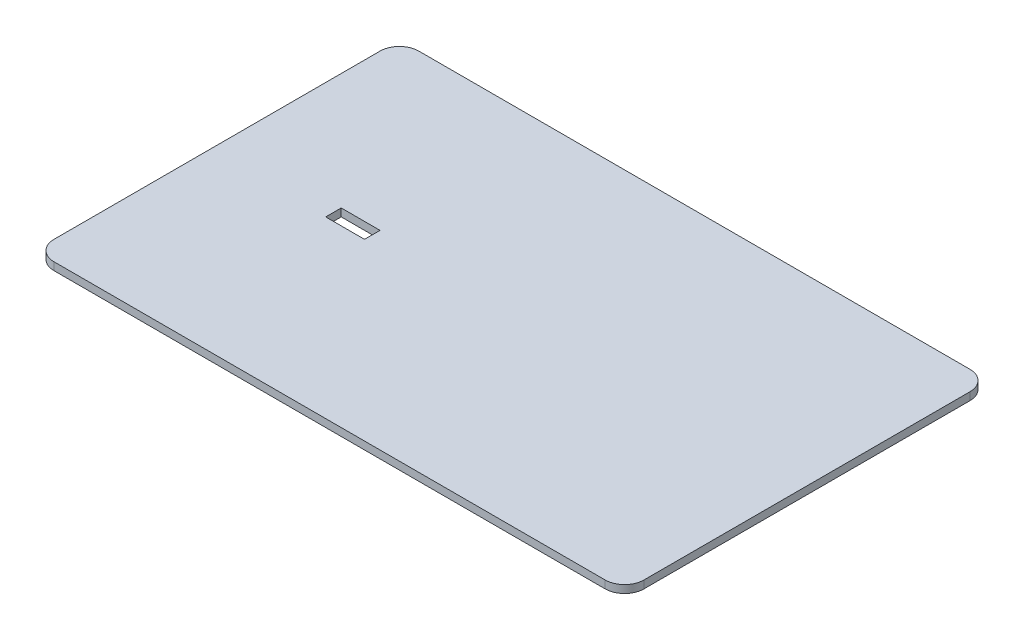
ISO-10303-21;
HEADER;
FILE_DESCRIPTION(('STEP AP214'),'2;1');
FILE_NAME('part.step','',(''),(''),'','','');
FILE_SCHEMA(('AUTOMOTIVE_DESIGN { 1 0 10303 214 1 1 1 1 }'));
ENDSEC;
DATA;
#1=APPLICATION_CONTEXT('core data for automotive mechanical design processes');
#2=APPLICATION_PROTOCOL_DEFINITION('international standard','automotive_design',2000,#1);
#3=PRODUCT_CONTEXT('',#1,'mechanical');
#4=PRODUCT('Part','Part','',(#3));
#5=PRODUCT_RELATED_PRODUCT_CATEGORY('part','',(#4));
#6=PRODUCT_DEFINITION_FORMATION('','',#4);
#7=PRODUCT_DEFINITION_CONTEXT('part definition',#1,'design');
#8=PRODUCT_DEFINITION('design','',#6,#7);
#9=PRODUCT_DEFINITION_SHAPE('','',#8);
#10=(LENGTH_UNIT() NAMED_UNIT(*) SI_UNIT(.MILLI.,.METRE.));
#11=(NAMED_UNIT(*) PLANE_ANGLE_UNIT() SI_UNIT($,.RADIAN.));
#12=(NAMED_UNIT(*) SI_UNIT($,.STERADIAN.) SOLID_ANGLE_UNIT());
#13=UNCERTAINTY_MEASURE_WITH_UNIT(LENGTH_MEASURE(1.E-05),#10,'distance_accuracy_value','');
#14=(GEOMETRIC_REPRESENTATION_CONTEXT(3) GLOBAL_UNCERTAINTY_ASSIGNED_CONTEXT((#13)) GLOBAL_UNIT_ASSIGNED_CONTEXT((#10,
#11,#12)) REPRESENTATION_CONTEXT('',''));
#15=CARTESIAN_POINT('',(0.,0.,0.));
#16=DIRECTION('',(0.,0.,1.));
#17=DIRECTION('',(1.,0.,0.));
#18=AXIS2_PLACEMENT_3D('',#15,#16,#17);
#19=CARTESIAN_POINT('',(0.,-1.,0.));
#20=DIRECTION('',(0.,1.,0.));
#21=DIRECTION('',(0.,0.,1.));
#22=AXIS2_PLACEMENT_3D('',#19,#20,#21);
#23=PLANE('',#22);
#24=DIRECTION('',(-1.,0.,0.));
#25=VECTOR('',#24,1.);
#26=CARTESIAN_POINT('',(-38.,-1.,-23.5));
#27=LINE('',#26,#25);
#28=CARTESIAN_POINT('',(35.5,-1.,-23.5));
#29=VERTEX_POINT('',#28);
#30=CARTESIAN_POINT('',(-35.5,-1.,-23.5));
#31=VERTEX_POINT('',#30);
#32=EDGE_CURVE('E314',#29,#31,#27,.T.);
#33=ORIENTED_EDGE('',*,*,#32,.F.);
#34=CARTESIAN_POINT('',(35.5,-1.,-21.));
#35=DIRECTION('',(0.,1.,0.));
#36=DIRECTION('',(0.,0.,1.));
#37=AXIS2_PLACEMENT_3D('',#34,#35,#36);
#38=CIRCLE('',#37,2.5);
#39=CARTESIAN_POINT('',(38.,-1.,-21.));
#40=VERTEX_POINT('',#39);
#41=EDGE_CURVE('E376',#29,#40,#38,.F.);
#42=ORIENTED_EDGE('',*,*,#41,.T.);
#43=DIRECTION('',(0.,0.,-1.));
#44=VECTOR('',#43,1.);
#45=CARTESIAN_POINT('',(38.,-1.,-23.5));
#46=LINE('',#45,#44);
#47=CARTESIAN_POINT('',(38.,-1.,21.));
#48=VERTEX_POINT('',#47);
#49=EDGE_CURVE('E310',#48,#40,#46,.T.);
#50=ORIENTED_EDGE('',*,*,#49,.F.);
#51=CARTESIAN_POINT('',(35.5,-1.,21.));
#52=DIRECTION('',(0.,1.,0.));
#53=DIRECTION('',(0.,0.,1.));
#54=AXIS2_PLACEMENT_3D('',#51,#52,#53);
#55=CIRCLE('',#54,2.5);
#56=CARTESIAN_POINT('',(35.5,-1.,23.5));
#57=VERTEX_POINT('',#56);
#58=EDGE_CURVE('E370',#48,#57,#55,.F.);
#59=ORIENTED_EDGE('',*,*,#58,.T.);
#60=DIRECTION('',(1.,0.,0.));
#61=VECTOR('',#60,1.);
#62=CARTESIAN_POINT('',(-38.,-1.,23.5));
#63=LINE('',#62,#61);
#64=CARTESIAN_POINT('',(-35.5,-1.,23.5));
#65=VERTEX_POINT('',#64);
#66=EDGE_CURVE('E323',#65,#57,#63,.T.);
#67=ORIENTED_EDGE('',*,*,#66,.F.);
#68=CARTESIAN_POINT('',(-35.5,-1.,21.));
#69=DIRECTION('',(0.,1.,0.));
#70=DIRECTION('',(0.,0.,1.));
#71=AXIS2_PLACEMENT_3D('',#68,#69,#70);
#72=CIRCLE('',#71,2.5);
#73=CARTESIAN_POINT('',(-38.,-1.,21.));
#74=VERTEX_POINT('',#73);
#75=EDGE_CURVE('E367',#65,#74,#72,.F.);
#76=ORIENTED_EDGE('',*,*,#75,.T.);
#77=DIRECTION('',(0.,0.,1.));
#78=VECTOR('',#77,1.);
#79=CARTESIAN_POINT('',(-38.,-1.,-23.5));
#80=LINE('',#79,#78);
#81=CARTESIAN_POINT('',(-38.,-1.,-21.));
#82=VERTEX_POINT('',#81);
#83=EDGE_CURVE('E319',#82,#74,#80,.T.);
#84=ORIENTED_EDGE('',*,*,#83,.F.);
#85=CARTESIAN_POINT('',(-35.5,-1.,-21.));
#86=DIRECTION('',(0.,1.,0.));
#87=DIRECTION('',(0.,0.,1.));
#88=AXIS2_PLACEMENT_3D('',#85,#86,#87);
#89=CIRCLE('',#88,2.5);
#90=EDGE_CURVE('E373',#82,#31,#89,.F.);
#91=ORIENTED_EDGE('',*,*,#90,.T.);
#92=EDGE_LOOP('',(#33,#42,#50,#59,#67,#76,#84,#91));
#93=FACE_BOUND('',#92,.T.);
#94=DIRECTION('',(0.,0.,1.));
#95=VECTOR('',#94,1.);
#96=CARTESIAN_POINT('',(33.,-1.,20.5));
#97=LINE('',#96,#95);
#98=CARTESIAN_POINT('',(33.,-1.,-20.5));
#99=VERTEX_POINT('',#98);
#100=CARTESIAN_POINT('',(33.,-1.,20.5));
#101=VERTEX_POINT('',#100);
#102=EDGE_CURVE('E264',#99,#101,#97,.T.);
#103=ORIENTED_EDGE('',*,*,#102,.F.);
#104=DIRECTION('',(1.,0.,0.));
#105=VECTOR('',#104,1.);
#106=CARTESIAN_POINT('',(-33.,-1.,-20.5));
#107=LINE('',#106,#105);
#108=CARTESIAN_POINT('',(-33.,-1.,-20.5));
#109=VERTEX_POINT('',#108);
#110=EDGE_CURVE('E270',#109,#99,#107,.T.);
#111=ORIENTED_EDGE('',*,*,#110,.F.);
#112=DIRECTION('',(0.,0.,-1.));
#113=VECTOR('',#112,1.);
#114=CARTESIAN_POINT('',(-33.,-1.,20.5));
#115=LINE('',#114,#113);
#116=CARTESIAN_POINT('',(-33.,-1.,20.5));
#117=VERTEX_POINT('',#116);
#118=EDGE_CURVE('E287',#117,#109,#115,.T.);
#119=ORIENTED_EDGE('',*,*,#118,.F.);
#120=DIRECTION('',(-1.,0.,0.));
#121=VECTOR('',#120,1.);
#122=CARTESIAN_POINT('',(-33.,-1.,20.5));
#123=LINE('',#122,#121);
#124=EDGE_CURVE('E283',#101,#117,#123,.T.);
#125=ORIENTED_EDGE('',*,*,#124,.F.);
#126=EDGE_LOOP('',(#103,#111,#119,#125));
#127=FACE_BOUND('',#126,.T.);
#128=ADVANCED_FACE('F45',(#93,#127),#23,.F.);
#129=CARTESIAN_POINT('',(38.,-1.,-23.5));
#130=DIRECTION('',(1.,0.,0.));
#131=DIRECTION('',(0.,0.,-1.));
#132=AXIS2_PLACEMENT_3D('',#129,#130,#131);
#133=PLANE('',#132);
#134=ORIENTED_EDGE('',*,*,#49,.T.);
#135=DIRECTION('',(0.,1.,0.));
#136=VECTOR('',#135,1.);
#137=CARTESIAN_POINT('',(38.,-1.,-21.));
#138=LINE('',#137,#136);
#139=CARTESIAN_POINT('',(38.,0.,-21.));
#140=VERTEX_POINT('',#139);
#141=EDGE_CURVE('E344',#40,#140,#138,.T.);
#142=ORIENTED_EDGE('',*,*,#141,.T.);
#143=DIRECTION('',(0.,0.,-1.));
#144=VECTOR('',#143,1.);
#145=CARTESIAN_POINT('',(38.,0.,-23.5));
#146=LINE('',#145,#144);
#147=CARTESIAN_POINT('',(38.,0.,21.));
#148=VERTEX_POINT('',#147);
#149=EDGE_CURVE('E309',#148,#140,#146,.T.);
#150=ORIENTED_EDGE('',*,*,#149,.F.);
#151=DIRECTION('',(0.,1.,0.));
#152=VECTOR('',#151,1.);
#153=CARTESIAN_POINT('',(38.,-1.,21.));
#154=LINE('',#153,#152);
#155=EDGE_CURVE('E327',#148,#48,#154,.F.);
#156=ORIENTED_EDGE('',*,*,#155,.T.);
#157=EDGE_LOOP('',(#134,#142,#150,#156));
#158=FACE_BOUND('',#157,.T.);
#159=ADVANCED_FACE('F419',(#158),#133,.T.);
#160=CARTESIAN_POINT('',(-38.,-1.,23.5));
#161=DIRECTION('',(0.,0.,1.));
#162=DIRECTION('',(1.,0.,0.));
#163=AXIS2_PLACEMENT_3D('',#160,#161,#162);
#164=PLANE('',#163);
#165=ORIENTED_EDGE('',*,*,#66,.T.);
#166=DIRECTION('',(0.,1.,0.));
#167=VECTOR('',#166,1.);
#168=CARTESIAN_POINT('',(35.5,-1.,23.5));
#169=LINE('',#168,#167);
#170=CARTESIAN_POINT('',(35.5,0.,23.5));
#171=VERTEX_POINT('',#170);
#172=EDGE_CURVE('E11',#57,#171,#169,.T.);
#173=ORIENTED_EDGE('',*,*,#172,.T.);
#174=DIRECTION('',(1.,0.,0.));
#175=VECTOR('',#174,1.);
#176=CARTESIAN_POINT('',(-38.,0.,23.5));
#177=LINE('',#176,#175);
#178=CARTESIAN_POINT('',(-35.5,0.,23.5));
#179=VERTEX_POINT('',#178);
#180=EDGE_CURVE('E315',#179,#171,#177,.T.);
#181=ORIENTED_EDGE('',*,*,#180,.F.);
#182=DIRECTION('',(0.,1.,0.));
#183=VECTOR('',#182,1.);
#184=CARTESIAN_POINT('',(-35.5,-1.,23.5));
#185=LINE('',#184,#183);
#186=EDGE_CURVE('E54',#179,#65,#185,.F.);
#187=ORIENTED_EDGE('',*,*,#186,.T.);
#188=EDGE_LOOP('',(#165,#173,#181,#187));
#189=FACE_BOUND('',#188,.T.);
#190=ADVANCED_FACE('F390',(#189),#164,.T.);
#191=CARTESIAN_POINT('',(-38.,-1.,-23.5));
#192=DIRECTION('',(-1.,0.,0.));
#193=DIRECTION('',(0.,0.,1.));
#194=AXIS2_PLACEMENT_3D('',#191,#192,#193);
#195=PLANE('',#194);
#196=DIRECTION('',(0.,0.,1.));
#197=VECTOR('',#196,1.);
#198=CARTESIAN_POINT('',(-38.,0.,-23.5));
#199=LINE('',#198,#197);
#200=CARTESIAN_POINT('',(-38.,0.,-21.));
#201=VERTEX_POINT('',#200);
#202=CARTESIAN_POINT('',(-38.,0.,21.));
#203=VERTEX_POINT('',#202);
#204=EDGE_CURVE('E335',#201,#203,#199,.T.);
#205=ORIENTED_EDGE('',*,*,#204,.F.);
#206=DIRECTION('',(0.,1.,0.));
#207=VECTOR('',#206,1.);
#208=CARTESIAN_POINT('',(-38.,-1.,-21.));
#209=LINE('',#208,#207);
#210=EDGE_CURVE('E383',#201,#82,#209,.F.);
#211=ORIENTED_EDGE('',*,*,#210,.T.);
#212=ORIENTED_EDGE('',*,*,#83,.T.);
#213=DIRECTION('',(0.,1.,0.));
#214=VECTOR('',#213,1.);
#215=CARTESIAN_POINT('',(-38.,-1.,21.));
#216=LINE('',#215,#214);
#217=EDGE_CURVE('E379',#74,#203,#216,.T.);
#218=ORIENTED_EDGE('',*,*,#217,.T.);
#219=EDGE_LOOP('',(#205,#211,#212,#218));
#220=FACE_BOUND('',#219,.T.);
#221=ADVANCED_FACE('F403',(#220),#195,.T.);
#222=CARTESIAN_POINT('',(-38.,-1.,-23.5));
#223=DIRECTION('',(0.,0.,-1.));
#224=DIRECTION('',(-1.,0.,0.));
#225=AXIS2_PLACEMENT_3D('',#222,#223,#224);
#226=PLANE('',#225);
#227=DIRECTION('',(-1.,0.,0.));
#228=VECTOR('',#227,1.);
#229=CARTESIAN_POINT('',(-38.,0.,-23.5));
#230=LINE('',#229,#228);
#231=CARTESIAN_POINT('',(35.5,0.,-23.5));
#232=VERTEX_POINT('',#231);
#233=CARTESIAN_POINT('',(-35.5,0.,-23.5));
#234=VERTEX_POINT('',#233);
#235=EDGE_CURVE('E331',#232,#234,#230,.T.);
#236=ORIENTED_EDGE('',*,*,#235,.F.);
#237=DIRECTION('',(0.,1.,0.));
#238=VECTOR('',#237,1.);
#239=CARTESIAN_POINT('',(35.5,-1.,-23.5));
#240=LINE('',#239,#238);
#241=EDGE_CURVE('E364',#232,#29,#240,.F.);
#242=ORIENTED_EDGE('',*,*,#241,.T.);
#243=ORIENTED_EDGE('',*,*,#32,.T.);
#244=DIRECTION('',(0.,1.,0.));
#245=VECTOR('',#244,1.);
#246=CARTESIAN_POINT('',(-35.5,-1.,-23.5));
#247=LINE('',#246,#245);
#248=EDGE_CURVE('E360',#31,#234,#247,.T.);
#249=ORIENTED_EDGE('',*,*,#248,.T.);
#250=EDGE_LOOP('',(#236,#242,#243,#249));
#251=FACE_BOUND('',#250,.T.);
#252=ADVANCED_FACE('F411',(#251),#226,.T.);
#253=CARTESIAN_POINT('',(0.,0.,0.));
#254=DIRECTION('',(0.,1.,0.));
#255=DIRECTION('',(0.,0.,1.));
#256=AXIS2_PLACEMENT_3D('',#253,#254,#255);
#257=PLANE('',#256);
#258=DIRECTION('',(0.,0.,-1.));
#259=VECTOR('',#258,1.);
#260=CARTESIAN_POINT('',(-18.,0.,-1.));
#261=LINE('',#260,#259);
#262=CARTESIAN_POINT('',(-18.,0.,1.));
#263=VERTEX_POINT('',#262);
#264=CARTESIAN_POINT('',(-18.,0.,-1.));
#265=VERTEX_POINT('',#264);
#266=EDGE_CURVE('E61',#263,#265,#261,.T.);
#267=ORIENTED_EDGE('',*,*,#266,.F.);
#268=DIRECTION('',(1.,0.,0.));
#269=VECTOR('',#268,1.);
#270=CARTESIAN_POINT('',(-23.,0.,1.));
#271=LINE('',#270,#269);
#272=CARTESIAN_POINT('',(-23.,0.,1.));
#273=VERTEX_POINT('',#272);
#274=EDGE_CURVE('E204',#273,#263,#271,.T.);
#275=ORIENTED_EDGE('',*,*,#274,.F.);
#276=DIRECTION('',(0.,0.,1.));
#277=VECTOR('',#276,1.);
#278=CARTESIAN_POINT('',(-23.,0.,-1.));
#279=LINE('',#278,#277);
#280=CARTESIAN_POINT('',(-23.,0.,-1.));
#281=VERTEX_POINT('',#280);
#282=EDGE_CURVE('E186',#281,#273,#279,.T.);
#283=ORIENTED_EDGE('',*,*,#282,.F.);
#284=DIRECTION('',(-1.,0.,0.));
#285=VECTOR('',#284,1.);
#286=CARTESIAN_POINT('',(-23.,0.,-1.));
#287=LINE('',#286,#285);
#288=EDGE_CURVE('E196',#265,#281,#287,.T.);
#289=ORIENTED_EDGE('',*,*,#288,.F.);
#290=EDGE_LOOP('',(#267,#275,#283,#289));
#291=FACE_BOUND('',#290,.T.);
#292=ORIENTED_EDGE('',*,*,#149,.T.);
#293=CARTESIAN_POINT('',(35.5,0.,-21.));
#294=DIRECTION('',(0.,1.,0.));
#295=DIRECTION('',(0.,0.,1.));
#296=AXIS2_PLACEMENT_3D('',#293,#294,#295);
#297=CIRCLE('',#296,2.5);
#298=EDGE_CURVE('E357',#140,#232,#297,.T.);
#299=ORIENTED_EDGE('',*,*,#298,.T.);
#300=ORIENTED_EDGE('',*,*,#235,.T.);
#301=CARTESIAN_POINT('',(-35.5,0.,-21.));
#302=DIRECTION('',(0.,1.,0.));
#303=DIRECTION('',(0.,0.,1.));
#304=AXIS2_PLACEMENT_3D('',#301,#302,#303);
#305=CIRCLE('',#304,2.5);
#306=EDGE_CURVE('E354',#234,#201,#305,.T.);
#307=ORIENTED_EDGE('',*,*,#306,.T.);
#308=ORIENTED_EDGE('',*,*,#204,.T.);
#309=CARTESIAN_POINT('',(-35.5,0.,21.));
#310=DIRECTION('',(0.,1.,0.));
#311=DIRECTION('',(0.,0.,1.));
#312=AXIS2_PLACEMENT_3D('',#309,#310,#311);
#313=CIRCLE('',#312,2.5);
#314=EDGE_CURVE('E348',#203,#179,#313,.T.);
#315=ORIENTED_EDGE('',*,*,#314,.T.);
#316=ORIENTED_EDGE('',*,*,#180,.T.);
#317=CARTESIAN_POINT('',(35.5,0.,21.));
#318=DIRECTION('',(0.,1.,0.));
#319=DIRECTION('',(0.,0.,1.));
#320=AXIS2_PLACEMENT_3D('',#317,#318,#319);
#321=CIRCLE('',#320,2.5);
#322=EDGE_CURVE('E351',#171,#148,#321,.T.);
#323=ORIENTED_EDGE('',*,*,#322,.T.);
#324=EDGE_LOOP('',(#292,#299,#300,#307,#308,#315,#316,#323));
#325=FACE_BOUND('',#324,.T.);
#326=ADVANCED_FACE('F201',(#291,#325),#257,.T.);
#327=CARTESIAN_POINT('',(0.,-3.5,0.));
#328=DIRECTION('',(0.,-1.,0.));
#329=DIRECTION('',(0.,0.,-1.));
#330=AXIS2_PLACEMENT_3D('',#327,#328,#329);
#331=PLANE('',#330);
#332=DIRECTION('',(0.,0.,1.));
#333=VECTOR('',#332,1.);
#334=CARTESIAN_POINT('',(33.,-3.5,20.5));
#335=LINE('',#334,#333);
#336=CARTESIAN_POINT('',(33.,-3.5,-20.5));
#337=VERTEX_POINT('',#336);
#338=CARTESIAN_POINT('',(33.,-3.5,20.5));
#339=VERTEX_POINT('',#338);
#340=EDGE_CURVE('E265',#337,#339,#335,.T.);
#341=ORIENTED_EDGE('',*,*,#340,.T.);
#342=DIRECTION('',(-1.,0.,0.));
#343=VECTOR('',#342,1.);
#344=CARTESIAN_POINT('',(-33.,-3.5,20.5));
#345=LINE('',#344,#343);
#346=CARTESIAN_POINT('',(-33.,-3.5,20.5));
#347=VERTEX_POINT('',#346);
#348=EDGE_CURVE('E269',#339,#347,#345,.T.);
#349=ORIENTED_EDGE('',*,*,#348,.T.);
#350=DIRECTION('',(0.,0.,-1.));
#351=VECTOR('',#350,1.);
#352=CARTESIAN_POINT('',(-33.,-3.5,20.5));
#353=LINE('',#352,#351);
#354=CARTESIAN_POINT('',(-33.,-3.5,-20.5));
#355=VERTEX_POINT('',#354);
#356=EDGE_CURVE('E273',#347,#355,#353,.T.);
#357=ORIENTED_EDGE('',*,*,#356,.T.);
#358=DIRECTION('',(1.,0.,0.));
#359=VECTOR('',#358,1.);
#360=CARTESIAN_POINT('',(-33.,-3.5,-20.5));
#361=LINE('',#360,#359);
#362=EDGE_CURVE('E276',#355,#337,#361,.T.);
#363=ORIENTED_EDGE('',*,*,#362,.T.);
#364=EDGE_LOOP('',(#341,#349,#357,#363));
#365=FACE_BOUND('',#364,.T.);
#366=DIRECTION('',(1.,0.,0.));
#367=VECTOR('',#366,1.);
#368=CARTESIAN_POINT('',(-30.5,-3.5,-18.));
#369=LINE('',#368,#367);
#370=CARTESIAN_POINT('',(-30.5,-3.5,-18.));
#371=VERTEX_POINT('',#370);
#372=CARTESIAN_POINT('',(30.5,-3.5,-18.));
#373=VERTEX_POINT('',#372);
#374=EDGE_CURVE('E226',#371,#373,#369,.T.);
#375=ORIENTED_EDGE('',*,*,#374,.F.);
#376=DIRECTION('',(0.,0.,-1.));
#377=VECTOR('',#376,1.);
#378=CARTESIAN_POINT('',(-30.5,-3.5,18.));
#379=LINE('',#378,#377);
#380=CARTESIAN_POINT('',(-30.5,-3.5,18.));
#381=VERTEX_POINT('',#380);
#382=EDGE_CURVE('E223',#381,#371,#379,.T.);
#383=ORIENTED_EDGE('',*,*,#382,.F.);
#384=DIRECTION('',(-1.,0.,0.));
#385=VECTOR('',#384,1.);
#386=CARTESIAN_POINT('',(-30.5,-3.5,18.));
#387=LINE('',#386,#385);
#388=CARTESIAN_POINT('',(30.5,-3.5,18.));
#389=VERTEX_POINT('',#388);
#390=EDGE_CURVE('E234',#389,#381,#387,.T.);
#391=ORIENTED_EDGE('',*,*,#390,.F.);
#392=DIRECTION('',(0.,0.,1.));
#393=VECTOR('',#392,1.);
#394=CARTESIAN_POINT('',(30.5,-3.5,18.));
#395=LINE('',#394,#393);
#396=EDGE_CURVE('E230',#373,#389,#395,.T.);
#397=ORIENTED_EDGE('',*,*,#396,.F.);
#398=EDGE_LOOP('',(#375,#383,#391,#397));
#399=FACE_BOUND('',#398,.T.);
#400=ADVANCED_FACE('F469',(#365,#399),#331,.T.);
#401=CARTESIAN_POINT('',(33.,-3.5,20.5));
#402=DIRECTION('',(-1.,0.,0.));
#403=DIRECTION('',(0.,0.,1.));
#404=AXIS2_PLACEMENT_3D('',#401,#402,#403);
#405=PLANE('',#404);
#406=ORIENTED_EDGE('',*,*,#102,.T.);
#407=DIRECTION('',(0.,1.,0.));
#408=VECTOR('',#407,1.);
#409=CARTESIAN_POINT('',(33.,-3.5,20.5));
#410=LINE('',#409,#408);
#411=EDGE_CURVE('E305',#339,#101,#410,.T.);
#412=ORIENTED_EDGE('',*,*,#411,.F.);
#413=ORIENTED_EDGE('',*,*,#340,.F.);
#414=DIRECTION('',(0.,1.,0.));
#415=VECTOR('',#414,1.);
#416=CARTESIAN_POINT('',(33.,-3.5,-20.5));
#417=LINE('',#416,#415);
#418=EDGE_CURVE('E279',#337,#99,#417,.T.);
#419=ORIENTED_EDGE('',*,*,#418,.T.);
#420=EDGE_LOOP('',(#406,#412,#413,#419));
#421=FACE_BOUND('',#420,.T.);
#422=ADVANCED_FACE('F484',(#421),#405,.F.);
#423=CARTESIAN_POINT('',(-33.,-3.5,20.5));
#424=DIRECTION('',(0.,0.,-1.));
#425=DIRECTION('',(-1.,0.,0.));
#426=AXIS2_PLACEMENT_3D('',#423,#424,#425);
#427=PLANE('',#426);
#428=ORIENTED_EDGE('',*,*,#124,.T.);
#429=DIRECTION('',(0.,1.,0.));
#430=VECTOR('',#429,1.);
#431=CARTESIAN_POINT('',(-33.,-3.5,20.5));
#432=LINE('',#431,#430);
#433=EDGE_CURVE('E301',#347,#117,#432,.T.);
#434=ORIENTED_EDGE('',*,*,#433,.F.);
#435=ORIENTED_EDGE('',*,*,#348,.F.);
#436=ORIENTED_EDGE('',*,*,#411,.T.);
#437=EDGE_LOOP('',(#428,#434,#435,#436));
#438=FACE_BOUND('',#437,.T.);
#439=ADVANCED_FACE('F492',(#438),#427,.F.);
#440=CARTESIAN_POINT('',(-33.,-3.5,20.5));
#441=DIRECTION('',(1.,0.,0.));
#442=DIRECTION('',(0.,0.,-1.));
#443=AXIS2_PLACEMENT_3D('',#440,#441,#442);
#444=PLANE('',#443);
#445=ORIENTED_EDGE('',*,*,#118,.T.);
#446=DIRECTION('',(0.,1.,0.));
#447=VECTOR('',#446,1.);
#448=CARTESIAN_POINT('',(-33.,-3.5,-20.5));
#449=LINE('',#448,#447);
#450=EDGE_CURVE('E297',#355,#109,#449,.T.);
#451=ORIENTED_EDGE('',*,*,#450,.F.);
#452=ORIENTED_EDGE('',*,*,#356,.F.);
#453=ORIENTED_EDGE('',*,*,#433,.T.);
#454=EDGE_LOOP('',(#445,#451,#452,#453));
#455=FACE_BOUND('',#454,.T.);
#456=ADVANCED_FACE('F488',(#455),#444,.F.);
#457=CARTESIAN_POINT('',(-33.,-3.5,-20.5));
#458=DIRECTION('',(0.,0.,1.));
#459=DIRECTION('',(1.,0.,0.));
#460=AXIS2_PLACEMENT_3D('',#457,#458,#459);
#461=PLANE('',#460);
#462=ORIENTED_EDGE('',*,*,#110,.T.);
#463=ORIENTED_EDGE('',*,*,#418,.F.);
#464=ORIENTED_EDGE('',*,*,#362,.F.);
#465=ORIENTED_EDGE('',*,*,#450,.T.);
#466=EDGE_LOOP('',(#462,#463,#464,#465));
#467=FACE_BOUND('',#466,.T.);
#468=ADVANCED_FACE('F481',(#467),#461,.F.);
#469=CARTESIAN_POINT('',(-30.5,-3.5,18.));
#470=DIRECTION('',(1.,0.,0.));
#471=DIRECTION('',(0.,0.,-1.));
#472=AXIS2_PLACEMENT_3D('',#469,#470,#471);
#473=PLANE('',#472);
#474=DIRECTION('',(0.,0.,-1.));
#475=VECTOR('',#474,1.);
#476=CARTESIAN_POINT('',(-30.5,-1.,18.));
#477=LINE('',#476,#475);
#478=CARTESIAN_POINT('',(-30.5,-1.,18.));
#479=VERTEX_POINT('',#478);
#480=CARTESIAN_POINT('',(-30.5,-1.,-18.));
#481=VERTEX_POINT('',#480);
#482=EDGE_CURVE('E221',#479,#481,#477,.T.);
#483=ORIENTED_EDGE('',*,*,#482,.F.);
#484=DIRECTION('',(0.,1.,0.));
#485=VECTOR('',#484,1.);
#486=CARTESIAN_POINT('',(-30.5,-3.5,18.));
#487=LINE('',#486,#485);
#488=EDGE_CURVE('E237',#381,#479,#487,.T.);
#489=ORIENTED_EDGE('',*,*,#488,.F.);
#490=ORIENTED_EDGE('',*,*,#382,.T.);
#491=DIRECTION('',(0.,1.,0.));
#492=VECTOR('',#491,1.);
#493=CARTESIAN_POINT('',(-30.5,-3.5,-18.));
#494=LINE('',#493,#492);
#495=EDGE_CURVE('E260',#371,#481,#494,.T.);
#496=ORIENTED_EDGE('',*,*,#495,.T.);
#497=EDGE_LOOP('',(#483,#489,#490,#496));
#498=FACE_BOUND('',#497,.T.);
#499=ADVANCED_FACE('F461',(#498),#473,.T.);
#500=CARTESIAN_POINT('',(-30.5,-3.5,-18.));
#501=DIRECTION('',(0.,0.,1.));
#502=DIRECTION('',(1.,0.,0.));
#503=AXIS2_PLACEMENT_3D('',#500,#501,#502);
#504=PLANE('',#503);
#505=DIRECTION('',(1.,0.,0.));
#506=VECTOR('',#505,1.);
#507=CARTESIAN_POINT('',(-30.5,-1.,-18.));
#508=LINE('',#507,#506);
#509=CARTESIAN_POINT('',(30.5,-1.,-18.));
#510=VERTEX_POINT('',#509);
#511=EDGE_CURVE('E241',#481,#510,#508,.T.);
#512=ORIENTED_EDGE('',*,*,#511,.F.);
#513=ORIENTED_EDGE('',*,*,#495,.F.);
#514=ORIENTED_EDGE('',*,*,#374,.T.);
#515=DIRECTION('',(0.,1.,0.));
#516=VECTOR('',#515,1.);
#517=CARTESIAN_POINT('',(30.5,-3.5,-18.));
#518=LINE('',#517,#516);
#519=EDGE_CURVE('E257',#373,#510,#518,.T.);
#520=ORIENTED_EDGE('',*,*,#519,.T.);
#521=EDGE_LOOP('',(#512,#513,#514,#520));
#522=FACE_BOUND('',#521,.T.);
#523=ADVANCED_FACE('F465',(#522),#504,.T.);
#524=CARTESIAN_POINT('',(30.5,-3.5,18.));
#525=DIRECTION('',(-1.,0.,0.));
#526=DIRECTION('',(0.,0.,1.));
#527=AXIS2_PLACEMENT_3D('',#524,#525,#526);
#528=PLANE('',#527);
#529=DIRECTION('',(0.,0.,1.));
#530=VECTOR('',#529,1.);
#531=CARTESIAN_POINT('',(30.5,-1.,18.));
#532=LINE('',#531,#530);
#533=CARTESIAN_POINT('',(30.5,-1.,18.));
#534=VERTEX_POINT('',#533);
#535=EDGE_CURVE('E245',#510,#534,#532,.T.);
#536=ORIENTED_EDGE('',*,*,#535,.F.);
#537=ORIENTED_EDGE('',*,*,#519,.F.);
#538=ORIENTED_EDGE('',*,*,#396,.T.);
#539=DIRECTION('',(0.,1.,0.));
#540=VECTOR('',#539,1.);
#541=CARTESIAN_POINT('',(30.5,-3.5,18.));
#542=LINE('',#541,#540);
#543=EDGE_CURVE('E254',#389,#534,#542,.T.);
#544=ORIENTED_EDGE('',*,*,#543,.T.);
#545=EDGE_LOOP('',(#536,#537,#538,#544));
#546=FACE_BOUND('',#545,.T.);
#547=ADVANCED_FACE('F447',(#546),#528,.T.);
#548=CARTESIAN_POINT('',(-30.5,-3.5,18.));
#549=DIRECTION('',(0.,0.,-1.));
#550=DIRECTION('',(-1.,0.,0.));
#551=AXIS2_PLACEMENT_3D('',#548,#549,#550);
#552=PLANE('',#551);
#553=DIRECTION('',(-1.,0.,0.));
#554=VECTOR('',#553,1.);
#555=CARTESIAN_POINT('',(-30.5,-1.,18.));
#556=LINE('',#555,#554);
#557=EDGE_CURVE('E227',#534,#479,#556,.T.);
#558=ORIENTED_EDGE('',*,*,#557,.F.);
#559=ORIENTED_EDGE('',*,*,#543,.F.);
#560=ORIENTED_EDGE('',*,*,#390,.T.);
#561=ORIENTED_EDGE('',*,*,#488,.T.);
#562=EDGE_LOOP('',(#558,#559,#560,#561));
#563=FACE_BOUND('',#562,.T.);
#564=ADVANCED_FACE('F440',(#563),#552,.T.);
#565=DIRECTION('',(-1.,0.,0.));
#566=VECTOR('',#565,1.);
#567=CARTESIAN_POINT('',(-23.,-1.,1.));
#568=LINE('',#567,#566);
#569=CARTESIAN_POINT('',(-18.,-1.,1.));
#570=VERTEX_POINT('',#569);
#571=CARTESIAN_POINT('',(-23.,-1.,1.));
#572=VERTEX_POINT('',#571);
#573=EDGE_CURVE('E453',#570,#572,#568,.T.);
#574=ORIENTED_EDGE('',*,*,#573,.F.);
#575=DIRECTION('',(0.,0.,1.));
#576=VECTOR('',#575,1.);
#577=CARTESIAN_POINT('',(-18.,-1.,-1.));
#578=LINE('',#577,#576);
#579=CARTESIAN_POINT('',(-18.,-1.,-1.));
#580=VERTEX_POINT('',#579);
#581=EDGE_CURVE('E222',#580,#570,#578,.T.);
#582=ORIENTED_EDGE('',*,*,#581,.F.);
#583=DIRECTION('',(1.,0.,0.));
#584=VECTOR('',#583,1.);
#585=CARTESIAN_POINT('',(-23.,-1.,-1.));
#586=LINE('',#585,#584);
#587=CARTESIAN_POINT('',(-23.,-1.,-1.));
#588=VERTEX_POINT('',#587);
#589=EDGE_CURVE('E218',#588,#580,#586,.T.);
#590=ORIENTED_EDGE('',*,*,#589,.F.);
#591=DIRECTION('',(0.,0.,-1.));
#592=VECTOR('',#591,1.);
#593=CARTESIAN_POINT('',(-23.,-1.,-1.));
#594=LINE('',#593,#592);
#595=EDGE_CURVE('E189',#572,#588,#594,.T.);
#596=ORIENTED_EDGE('',*,*,#595,.F.);
#597=EDGE_LOOP('',(#574,#582,#590,#596));
#598=FACE_BOUND('',#597,.T.);
#599=ORIENTED_EDGE('',*,*,#557,.T.);
#600=ORIENTED_EDGE('',*,*,#482,.T.);
#601=ORIENTED_EDGE('',*,*,#511,.T.);
#602=ORIENTED_EDGE('',*,*,#535,.T.);
#603=EDGE_LOOP('',(#599,#600,#601,#602));
#604=FACE_BOUND('',#603,.T.);
#605=ADVANCED_FACE('F432',(#598,#604),#23,.F.);
#606=CARTESIAN_POINT('',(35.5,-1.,-21.));
#607=DIRECTION('',(0.,1.,0.));
#608=DIRECTION('',(0.,0.,1.));
#609=AXIS2_PLACEMENT_3D('',#606,#607,#608);
#610=CYLINDRICAL_SURFACE('',#609,2.5);
#611=ORIENTED_EDGE('',*,*,#41,.F.);
#612=ORIENTED_EDGE('',*,*,#241,.F.);
#613=ORIENTED_EDGE('',*,*,#298,.F.);
#614=ORIENTED_EDGE('',*,*,#141,.F.);
#615=EDGE_LOOP('',(#611,#612,#613,#614));
#616=FACE_BOUND('',#615,.T.);
#617=ADVANCED_FACE('F416',(#616),#610,.T.);
#618=CARTESIAN_POINT('',(-35.5,-1.,-21.));
#619=DIRECTION('',(0.,1.,0.));
#620=DIRECTION('',(0.,0.,1.));
#621=AXIS2_PLACEMENT_3D('',#618,#619,#620);
#622=CYLINDRICAL_SURFACE('',#621,2.5);
#623=ORIENTED_EDGE('',*,*,#90,.F.);
#624=ORIENTED_EDGE('',*,*,#210,.F.);
#625=ORIENTED_EDGE('',*,*,#306,.F.);
#626=ORIENTED_EDGE('',*,*,#248,.F.);
#627=EDGE_LOOP('',(#623,#624,#625,#626));
#628=FACE_BOUND('',#627,.T.);
#629=ADVANCED_FACE('F409',(#628),#622,.T.);
#630=CARTESIAN_POINT('',(35.5,-1.,21.));
#631=DIRECTION('',(0.,1.,0.));
#632=DIRECTION('',(0.,0.,1.));
#633=AXIS2_PLACEMENT_3D('',#630,#631,#632);
#634=CYLINDRICAL_SURFACE('',#633,2.5);
#635=ORIENTED_EDGE('',*,*,#58,.F.);
#636=ORIENTED_EDGE('',*,*,#155,.F.);
#637=ORIENTED_EDGE('',*,*,#322,.F.);
#638=ORIENTED_EDGE('',*,*,#172,.F.);
#639=EDGE_LOOP('',(#635,#636,#637,#638));
#640=FACE_BOUND('',#639,.T.);
#641=ADVANCED_FACE('F422',(#640),#634,.T.);
#642=CARTESIAN_POINT('',(-35.5,-1.,21.));
#643=DIRECTION('',(0.,1.,0.));
#644=DIRECTION('',(0.,0.,1.));
#645=AXIS2_PLACEMENT_3D('',#642,#643,#644);
#646=CYLINDRICAL_SURFACE('',#645,2.5);
#647=ORIENTED_EDGE('',*,*,#75,.F.);
#648=ORIENTED_EDGE('',*,*,#186,.F.);
#649=ORIENTED_EDGE('',*,*,#314,.F.);
#650=ORIENTED_EDGE('',*,*,#217,.F.);
#651=EDGE_LOOP('',(#647,#648,#649,#650));
#652=FACE_BOUND('',#651,.T.);
#653=ADVANCED_FACE('F47',(#652),#646,.T.);
#654=CARTESIAN_POINT('',(-18.,-6.3851648071345,-1.));
#655=DIRECTION('',(1.,0.,0.));
#656=DIRECTION('',(0.,0.,-1.));
#657=AXIS2_PLACEMENT_3D('',#654,#655,#656);
#658=PLANE('',#657);
#659=ORIENTED_EDGE('',*,*,#581,.T.);
#660=DIRECTION('',(0.,1.,0.));
#661=VECTOR('',#660,1.);
#662=CARTESIAN_POINT('',(-18.,-6.3851648071345,1.));
#663=LINE('',#662,#661);
#664=EDGE_CURVE('E211',#570,#263,#663,.T.);
#665=ORIENTED_EDGE('',*,*,#664,.T.);
#666=ORIENTED_EDGE('',*,*,#266,.T.);
#667=DIRECTION('',(0.,1.,0.));
#668=VECTOR('',#667,1.);
#669=CARTESIAN_POINT('',(-18.,-6.3851648071345,-1.));
#670=LINE('',#669,#668);
#671=EDGE_CURVE('E193',#580,#265,#670,.T.);
#672=ORIENTED_EDGE('',*,*,#671,.F.);
#673=EDGE_LOOP('',(#659,#665,#666,#672));
#674=FACE_BOUND('',#673,.T.);
#675=ADVANCED_FACE('F428',(#674),#658,.F.);
#676=CARTESIAN_POINT('',(-23.,-6.3851648071345,1.));
#677=DIRECTION('',(0.,0.,1.));
#678=DIRECTION('',(1.,0.,0.));
#679=AXIS2_PLACEMENT_3D('',#676,#677,#678);
#680=PLANE('',#679);
#681=ORIENTED_EDGE('',*,*,#573,.T.);
#682=DIRECTION('',(0.,1.,0.));
#683=VECTOR('',#682,1.);
#684=CARTESIAN_POINT('',(-23.,-6.3851648071345,1.));
#685=LINE('',#684,#683);
#686=EDGE_CURVE('E192',#572,#273,#685,.T.);
#687=ORIENTED_EDGE('',*,*,#686,.T.);
#688=ORIENTED_EDGE('',*,*,#274,.T.);
#689=ORIENTED_EDGE('',*,*,#664,.F.);
#690=EDGE_LOOP('',(#681,#687,#688,#689));
#691=FACE_BOUND('',#690,.T.);
#692=ADVANCED_FACE('F578',(#691),#680,.F.);
#693=CARTESIAN_POINT('',(-23.,-6.3851648071345,-1.));
#694=DIRECTION('',(-1.,0.,0.));
#695=DIRECTION('',(0.,0.,1.));
#696=AXIS2_PLACEMENT_3D('',#693,#694,#695);
#697=PLANE('',#696);
#698=ORIENTED_EDGE('',*,*,#595,.T.);
#699=DIRECTION('',(0.,1.,0.));
#700=VECTOR('',#699,1.);
#701=CARTESIAN_POINT('',(-23.,-6.3851648071345,-1.));
#702=LINE('',#701,#700);
#703=EDGE_CURVE('E69',#588,#281,#702,.T.);
#704=ORIENTED_EDGE('',*,*,#703,.T.);
#705=ORIENTED_EDGE('',*,*,#282,.T.);
#706=ORIENTED_EDGE('',*,*,#686,.F.);
#707=EDGE_LOOP('',(#698,#704,#705,#706));
#708=FACE_BOUND('',#707,.T.);
#709=ADVANCED_FACE('F183',(#708),#697,.F.);
#710=CARTESIAN_POINT('',(-23.,-6.3851648071345,-1.));
#711=DIRECTION('',(0.,0.,-1.));
#712=DIRECTION('',(-1.,0.,0.));
#713=AXIS2_PLACEMENT_3D('',#710,#711,#712);
#714=PLANE('',#713);
#715=ORIENTED_EDGE('',*,*,#589,.T.);
#716=ORIENTED_EDGE('',*,*,#671,.T.);
#717=ORIENTED_EDGE('',*,*,#288,.T.);
#718=ORIENTED_EDGE('',*,*,#703,.F.);
#719=EDGE_LOOP('',(#715,#716,#717,#718));
#720=FACE_BOUND('',#719,.T.);
#721=ADVANCED_FACE('F197',(#720),#714,.F.);
#722=CLOSED_SHELL('',(#128,#159,#190,#221,#252,#326,#400,#422,#439,#456,#468,#499,#523,#547,
#564,#605,#617,#629,#641,#653,#675,#692,#709,#721));
#723=MANIFOLD_SOLID_BREP('B2',#722);
#724=ADVANCED_BREP_SHAPE_REPRESENTATION('',(#18,#723),#14);
#725=SHAPE_DEFINITION_REPRESENTATION(#9,#724);
ENDSEC;
END-ISO-10303-21;
